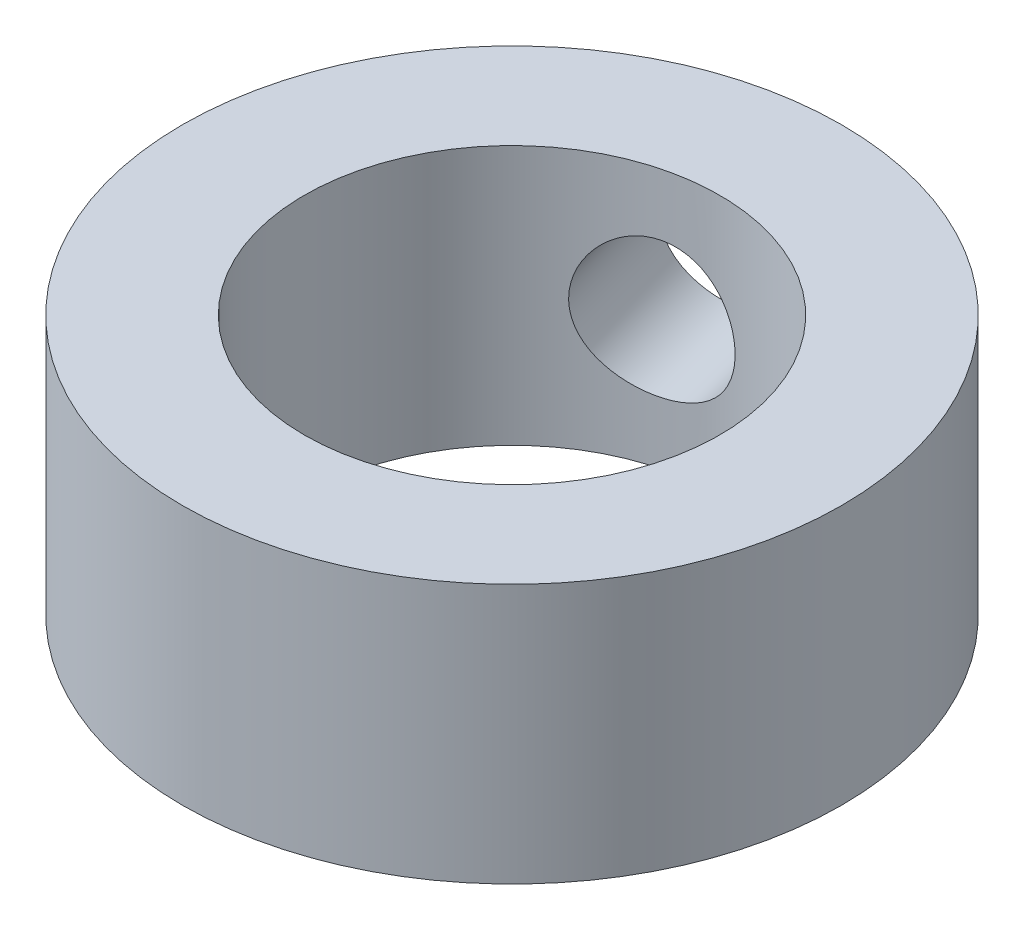
ISO-10303-21;
HEADER;
FILE_DESCRIPTION(('STEP AP214'),'2;1');
FILE_NAME('part.step','',(''),(''),'','','');
FILE_SCHEMA(('AUTOMOTIVE_DESIGN { 1 0 10303 214 1 1 1 1 }'));
ENDSEC;
DATA;
#1=APPLICATION_CONTEXT('core data for automotive mechanical design processes');
#2=APPLICATION_PROTOCOL_DEFINITION('international standard','automotive_design',2000,#1);
#3=PRODUCT_CONTEXT('',#1,'mechanical');
#4=PRODUCT('Part','Part','',(#3));
#5=PRODUCT_RELATED_PRODUCT_CATEGORY('part','',(#4));
#6=PRODUCT_DEFINITION_FORMATION('','',#4);
#7=PRODUCT_DEFINITION_CONTEXT('part definition',#1,'design');
#8=PRODUCT_DEFINITION('design','',#6,#7);
#9=PRODUCT_DEFINITION_SHAPE('','',#8);
#10=(LENGTH_UNIT() NAMED_UNIT(*) SI_UNIT(.MILLI.,.METRE.));
#11=(NAMED_UNIT(*) PLANE_ANGLE_UNIT() SI_UNIT($,.RADIAN.));
#12=(NAMED_UNIT(*) SI_UNIT($,.STERADIAN.) SOLID_ANGLE_UNIT());
#13=UNCERTAINTY_MEASURE_WITH_UNIT(LENGTH_MEASURE(1.E-05),#10,'distance_accuracy_value','');
#14=(GEOMETRIC_REPRESENTATION_CONTEXT(3) GLOBAL_UNCERTAINTY_ASSIGNED_CONTEXT((#13)) GLOBAL_UNIT_ASSIGNED_CONTEXT((#10,
#11,#12)) REPRESENTATION_CONTEXT('',''));
#15=CARTESIAN_POINT('',(0.,0.,0.));
#16=DIRECTION('',(0.,0.,1.));
#17=DIRECTION('',(1.,0.,0.));
#18=AXIS2_PLACEMENT_3D('',#15,#16,#17);
#19=CARTESIAN_POINT('',(0.,20.,0.));
#20=DIRECTION('',(0.,-1.,0.));
#21=DIRECTION('',(0.,0.,-1.));
#22=AXIS2_PLACEMENT_3D('',#19,#20,#21);
#23=CYLINDRICAL_SURFACE('',#22,25.4);
#24=CARTESIAN_POINT('',(-11.3949661213959,10.,-22.700545083593));
#25=CARTESIAN_POINT('',(-11.3949686574322,9.8542037203055,-22.7005426287149));
#26=CARTESIAN_POINT('',(-11.3894176177606,9.7084451930408,-22.7033324910437));
#27=CARTESIAN_POINT('',(-11.3672560080408,9.41793980072636,-22.7144372196689));
#28=CARTESIAN_POINT('',(-11.3506436402837,9.27319310398597,-22.7227529840455));
#29=CARTESIAN_POINT('',(-11.306457133404,8.98573026429417,-22.7447715199994));
#30=CARTESIAN_POINT('',(-11.2788775489652,8.8430151665637,-22.7584769675627));
#31=CARTESIAN_POINT('',(-11.2129304389085,8.56064333434581,-22.7910408502947));
#32=CARTESIAN_POINT('',(-11.1745589399879,8.42098774674183,-22.8099011832862));
#33=CARTESIAN_POINT('',(-11.0873451358636,8.14596077252988,-22.8524205593688));
#34=CARTESIAN_POINT('',(-11.0385177489886,8.01058359409658,-22.8760727629146));
#35=CARTESIAN_POINT('',(-10.9306494178329,7.74477973608957,-22.9278101947273));
#36=CARTESIAN_POINT('',(-10.8716047050656,7.61435490482544,-22.9558970583072));
#37=CARTESIAN_POINT('',(-10.7437043746201,7.35943648530064,-23.0160336538669));
#38=CARTESIAN_POINT('',(-10.6748530085746,7.23494035772483,-23.0480816677148));
#39=CARTESIAN_POINT('',(-10.5277034509867,6.99259326121771,-23.1156660092184));
#40=CARTESIAN_POINT('',(-10.4494017287135,6.87474480018852,-23.1512036396934));
#41=CARTESIAN_POINT('',(-10.2827353659178,6.64500595445793,-23.2257140332537));
#42=CARTESIAN_POINT('',(-10.194251651498,6.53321462177375,-23.2647259126189));
#43=CARTESIAN_POINT('',(-10.0085634958785,6.31800282425375,-23.3452114411407));
#44=CARTESIAN_POINT('',(-9.91135583404942,6.21458547787581,-23.3866859975187));
#45=CARTESIAN_POINT('',(-9.70884860480748,6.01689422168651,-23.4714784758814));
#46=CARTESIAN_POINT('',(-9.60355141528477,5.92261764326848,-23.5147958545164));
#47=CARTESIAN_POINT('',(-9.38542423585369,5.74378793532573,-23.6027041186518));
#48=CARTESIAN_POINT('',(-9.27259148455468,5.65923840149988,-23.6472954675327));
#49=CARTESIAN_POINT('',(-9.03906091367094,5.4997835069332,-23.7375479700936));
#50=CARTESIAN_POINT('',(-8.91830148441343,5.42497172243659,-23.7832151384452));
#51=CARTESIAN_POINT('',(-8.67056065003231,5.28642121153233,-23.8746481038485));
#52=CARTESIAN_POINT('',(-8.54357693161173,5.22268664266526,-23.9204139314331));
#53=CARTESIAN_POINT('',(-8.28430189383663,5.1068372046235,-24.0114386749655));
#54=CARTESIAN_POINT('',(-8.15201298443859,5.05471712840042,-24.0566978093972));
#55=CARTESIAN_POINT('',(-7.88297292897661,4.9624564037448,-24.1461986472177));
#56=CARTESIAN_POINT('',(-7.74622018451666,4.92232009980148,-24.190439976269));
#57=CARTESIAN_POINT('',(-7.33466771205289,4.82142645201832,-24.3196233167342));
#58=CARTESIAN_POINT('',(-7.0545984778643,4.77841538664733,-24.4024305901958));
#59=CARTESIAN_POINT('',(-6.48891895342731,4.74186526558015,-24.5589126875293));
#60=CARTESIAN_POINT('',(-6.20330923490009,4.74832113220614,-24.6325884479432));
#61=CARTESIAN_POINT('',(-5.63910857041918,4.80993441530352,-24.7677876712837));
#62=CARTESIAN_POINT('',(-5.36047693423994,4.86434984618236,-24.8294788738038));
#63=CARTESIAN_POINT('',(-4.81388408458172,5.01917670288689,-24.9412191108017));
#64=CARTESIAN_POINT('',(-4.54592331865241,5.11959005571928,-24.9912676573972));
#65=CARTESIAN_POINT('',(-4.02659474532817,5.36423436433418,-25.0802006450813));
#66=CARTESIAN_POINT('',(-3.77534938271638,5.50875279704981,-25.1190084838859));
#67=CARTESIAN_POINT('',(-3.29858450593492,5.83729290757149,-25.1860554697708));
#68=CARTESIAN_POINT('',(-3.07306814792324,6.021319423843,-25.2142933212057));
#69=CARTESIAN_POINT('',(-2.65035602926807,6.42771258218978,-25.2622599889264));
#70=CARTESIAN_POINT('',(-2.45376521109053,6.65072882180872,-25.2818207264009));
#71=CARTESIAN_POINT('',(-2.1000912229296,7.12663153743517,-25.3136572496695));
#72=CARTESIAN_POINT('',(-1.94300890549092,7.37951865784642,-25.3259328782677));
#73=CARTESIAN_POINT('',(-1.6731808382118,7.90892543762998,-25.3451947219864));
#74=CARTESIAN_POINT('',(-1.56054288741701,8.18550060030619,-25.3521681141036));
#75=CARTESIAN_POINT('',(-1.38416161698901,8.7538857702709,-25.362412780928));
#76=CARTESIAN_POINT('',(-1.32041144965996,9.04569363780149,-25.3656845741476));
#77=CARTESIAN_POINT('',(-1.2448794901046,9.63055467969738,-25.3695032375983));
#78=CARTESIAN_POINT('',(-1.23217039250848,9.92348790931901,-25.3700987540148));
#79=CARTESIAN_POINT('',(-1.25663836106811,10.5072437760056,-25.3688983881113));
#80=CARTESIAN_POINT('',(-1.2938123925861,10.7980665403785,-25.3671026512631));
#81=CARTESIAN_POINT('',(-1.41602124160598,11.366252029287,-25.3605703034939));
#82=CARTESIAN_POINT('',(-1.50055644832922,11.6437229527907,-25.355864339485));
#83=CARTESIAN_POINT('',(-1.71419326768912,12.1808278783068,-25.342314960731));
#84=CARTESIAN_POINT('',(-1.84329876227715,12.4404603242737,-25.3334711855698));
#85=CARTESIAN_POINT('',(-2.14397000662465,12.938481550661,-25.3098076355169));
#86=CARTESIAN_POINT('',(-2.31609949545547,13.1765259885616,-25.2949067261043));
#87=CARTESIAN_POINT('',(-2.69653544852218,13.620997015399,-25.2571801836372));
#88=CARTESIAN_POINT('',(-2.90484590217691,13.8274201129459,-25.2343536764055));
#89=CARTESIAN_POINT('',(-3.35518032006567,14.2062648123818,-25.1784629719225));
#90=CARTESIAN_POINT('',(-3.59770339789317,14.3780698702064,-25.1452362251814));
#91=CARTESIAN_POINT('',(-4.10652990913368,14.6784148372513,-25.0671605428036));
#92=CARTESIAN_POINT('',(-4.37283230116776,14.8069566399454,-25.0223121159572));
#93=CARTESIAN_POINT('',(-4.91952685253712,15.016245798997,-24.9205759070931));
#94=CARTESIAN_POINT('',(-5.19982463170899,15.0972759757957,-24.8637621610279));
#95=CARTESIAN_POINT('',(-5.76771841094052,15.2101175687805,-24.7381833621658));
#96=CARTESIAN_POINT('',(-6.05531346425939,15.2419353368822,-24.6694198530164));
#97=CARTESIAN_POINT('',(-6.48260534526029,15.2519554704946,-24.5592586302906));
#98=CARTESIAN_POINT('',(-6.62310762087678,15.2491994670923,-24.5217365484845));
#99=CARTESIAN_POINT('',(-6.90273319627944,15.231645194805,-24.4444929392524));
#100=CARTESIAN_POINT('',(-7.0418569998955,15.2168515033976,-24.4047722532224));
#101=CARTESIAN_POINT('',(-7.31779665240007,15.175326970636,-24.323457213974));
#102=CARTESIAN_POINT('',(-7.45461168994115,15.1485920199507,-24.2818622201866));
#103=CARTESIAN_POINT('',(-7.7249106990165,15.0834102514887,-24.1972270869507));
#104=CARTESIAN_POINT('',(-7.85839584118089,15.0449676141799,-24.1541874682078));
#105=CARTESIAN_POINT('',(-8.12089693126966,14.9567629296061,-24.0671999296165));
#106=CARTESIAN_POINT('',(-8.24992226514935,14.9070265635644,-24.0232542730534));
#107=CARTESIAN_POINT('',(-8.50294795679098,14.7965780743989,-23.9348664087266));
#108=CARTESIAN_POINT('',(-8.62695007233581,14.7358698320134,-23.8904243817262));
#109=CARTESIAN_POINT('',(-8.86926055008253,14.6038777737804,-23.8015310603052));
#110=CARTESIAN_POINT('',(-8.98756652081793,14.532589566448,-23.757079769727));
#111=CARTESIAN_POINT('',(-9.21768035953034,14.3799832637829,-23.6687463804406));
#112=CARTESIAN_POINT('',(-9.32949043158483,14.2986686000429,-23.6248640926403));
#113=CARTESIAN_POINT('',(-9.54790174052592,14.1250348061434,-23.5374521038117));
#114=CARTESIAN_POINT('',(-9.65437752882324,14.0325479538123,-23.493942022797));
#115=CARTESIAN_POINT('',(-9.85930555876516,13.8384118874026,-23.408682342555));
#116=CARTESIAN_POINT('',(-9.95776059525009,13.7367658910651,-23.3669321325668));
#117=CARTESIAN_POINT('',(-10.1461691308755,13.524904528005,-23.2857420627589));
#118=CARTESIAN_POINT('',(-10.2361175083268,13.414684070637,-23.2463036001603));
#119=CARTESIAN_POINT('',(-10.4068857511373,13.1865058304199,-23.1703573787391));
#120=CARTESIAN_POINT('',(-10.4877089524723,13.0685509002262,-23.1338485503241));
#121=CARTESIAN_POINT('',(-10.6407025457246,12.8241869344816,-23.0638811412704));
#122=CARTESIAN_POINT('',(-10.7127568187653,12.6976930925081,-23.0304646605911));
#123=CARTESIAN_POINT('',(-10.8465881368712,12.4384694470746,-22.9677379682637));
#124=CARTESIAN_POINT('',(-10.9083689681205,12.3057419641972,-22.9384262444759));
#125=CARTESIAN_POINT('',(-11.0212577552656,12.0350083254939,-22.8844007281955));
#126=CARTESIAN_POINT('',(-11.0723720045759,11.8970053394785,-22.8596842254106));
#127=CARTESIAN_POINT('',(-11.1636240500915,11.6166816107176,-22.8152594468278));
#128=CARTESIAN_POINT('',(-11.2037639166728,11.4743616880212,-22.795550226429));
#129=CARTESIAN_POINT('',(-11.2902209651342,11.1137277716083,-22.7528972478988));
#130=CARTESIAN_POINT('',(-11.3294546175725,10.8932657361951,-22.7333300932618));
#131=CARTESIAN_POINT('',(-11.3818247361304,10.448505940335,-22.7071561517606));
#132=CARTESIAN_POINT('',(-11.3949622214303,10.2242083300307,-22.7005488587519));
#133=CARTESIAN_POINT('',(-11.3949661213959,10.,-22.700545083593));
#134=B_SPLINE_CURVE_WITH_KNOTS('',3,(#24,#25,#26,#27,#28,#29,#30,#31,#32,#33,#34,#35,#36,#37,
#38,#39,#40,#41,#42,#43,#44,#45,#46,#47,#48,#49,#50,#51,#52,#53,#54,#55,#56,#57,#58,#59,#60,#61,
#62,#63,#64,#65,#66,#67,#68,#69,#70,#71,#72,#73,#74,#75,#76,#77,#78,#79,#80,#81,#82,#83,#84,#85,
#86,#87,#88,#89,#90,#91,#92,#93,#94,#95,#96,#97,#98,#99,#100,#101,#102,#103,#104,#105,#106,#107,
#108,#109,#110,#111,#112,#113,#114,#115,#116,#117,#118,#119,#120,#121,#122,#123,#124,#125,#126,
#127,#128,#129,#130,#131,#132,#133),.UNSPECIFIED.,.T.,.F.,(4,2,2,2,2,2,2,2,2,2,2,2,2,2,2,2,2,2,
2,2,2,2,2,2,2,2,2,2,2,2,2,2,2,2,2,2,2,2,2,2,2,2,2,2,2,2,2,2,2,2,2,2,2,2,4),(0.,0.4371916397258,
0.874454350055236,1.31193443665189,1.7495758033862,2.18659686061223,2.62377945052163,
3.06077307547454,3.4979304731905,3.94085215316001,4.3839380249814,4.82689414786428,
5.27001349130048,5.7171181376969,6.16439023233453,6.61146139920692,7.05869444700077,
7.93962195082291,8.82045903047761,9.68790323484875,10.5553837826813,11.4286439072557,
12.302011039088,13.1916265992847,14.0812613546412,14.973040831461,15.8646953741945,
16.7400751502552,17.6154016750434,18.4816637199906,19.348001233059,20.2263470986855,
21.1047898748464,21.997712334715,22.8905957095617,23.7781086318926,24.6655069921027,
25.1014381543361,25.5372036258546,25.9731191724935,26.408879248748,26.8436581847924,
27.2782836399915,27.7130900047779,28.147747966361,28.5900149264529,29.0321271130111,
29.4745038140649,29.9167182640668,30.3642662698568,30.8116489685513,31.2587669549517,
31.7058005318568,32.378148523901,33.0504702570186),.UNSPECIFIED.);
#135=CARTESIAN_POINT('',(-11.3949661213959,10.,-22.700545083593));
#136=VERTEX_POINT('',#135);
#137=EDGE_CURVE('E10',#136,#136,#134,.T.);
#138=ORIENTED_EDGE('',*,*,#137,.T.);
#139=EDGE_LOOP('',(#138));
#140=FACE_BOUND('',#139,.T.);
#141=CARTESIAN_POINT('',(0.,20.,0.));
#142=DIRECTION('',(0.,1.,0.));
#143=DIRECTION('',(0.,0.,1.));
#144=AXIS2_PLACEMENT_3D('',#141,#142,#143);
#145=CIRCLE('',#144,25.4);
#146=CARTESIAN_POINT('',(0.,20.,25.4));
#147=VERTEX_POINT('',#146);
#148=EDGE_CURVE('E39',#147,#147,#145,.T.);
#149=ORIENTED_EDGE('',*,*,#148,.F.);
#150=EDGE_LOOP('',(#149));
#151=FACE_BOUND('',#150,.T.);
#152=CARTESIAN_POINT('',(0.,0.,0.));
#153=DIRECTION('',(0.,1.,0.));
#154=DIRECTION('',(0.,0.,1.));
#155=AXIS2_PLACEMENT_3D('',#152,#153,#154);
#156=CIRCLE('',#155,25.4);
#157=CARTESIAN_POINT('',(0.,0.,25.4));
#158=VERTEX_POINT('',#157);
#159=EDGE_CURVE('E43',#158,#158,#156,.T.);
#160=ORIENTED_EDGE('',*,*,#159,.T.);
#161=EDGE_LOOP('',(#160));
#162=FACE_BOUND('',#161,.T.);
#163=ADVANCED_FACE('F29',(#140,#151,#162),#23,.T.);
#164=CARTESIAN_POINT('',(0.,20.,0.));
#165=DIRECTION('',(0.,1.,0.));
#166=DIRECTION('',(0.,0.,1.));
#167=AXIS2_PLACEMENT_3D('',#164,#165,#166);
#168=PLANE('',#167);
#169=CARTESIAN_POINT('',(0.,20.,0.));
#170=DIRECTION('',(0.,1.,0.));
#171=DIRECTION('',(0.,0.,1.));
#172=AXIS2_PLACEMENT_3D('',#169,#170,#171);
#173=CIRCLE('',#172,16.);
#174=CARTESIAN_POINT('',(0.,20.,16.));
#175=VERTEX_POINT('',#174);
#176=EDGE_CURVE('E50',#175,#175,#173,.T.);
#177=ORIENTED_EDGE('',*,*,#176,.F.);
#178=EDGE_LOOP('',(#177));
#179=FACE_BOUND('',#178,.T.);
#180=ORIENTED_EDGE('',*,*,#148,.T.);
#181=EDGE_LOOP('',(#180));
#182=FACE_BOUND('',#181,.T.);
#183=ADVANCED_FACE('F75',(#179,#182),#168,.T.);
#184=CARTESIAN_POINT('',(0.,0.,0.));
#185=DIRECTION('',(0.,1.,0.));
#186=DIRECTION('',(0.,0.,1.));
#187=AXIS2_PLACEMENT_3D('',#184,#185,#186);
#188=PLANE('',#187);
#189=CARTESIAN_POINT('',(0.,0.,0.));
#190=DIRECTION('',(0.,1.,0.));
#191=DIRECTION('',(0.,0.,1.));
#192=AXIS2_PLACEMENT_3D('',#189,#190,#191);
#193=CIRCLE('',#192,16.);
#194=CARTESIAN_POINT('',(0.,0.,16.));
#195=VERTEX_POINT('',#194);
#196=EDGE_CURVE('E48',#195,#195,#193,.T.);
#197=ORIENTED_EDGE('',*,*,#196,.T.);
#198=EDGE_LOOP('',(#197));
#199=FACE_BOUND('',#198,.T.);
#200=ORIENTED_EDGE('',*,*,#159,.F.);
#201=EDGE_LOOP('',(#200));
#202=FACE_BOUND('',#201,.T.);
#203=ADVANCED_FACE('F71',(#199,#202),#188,.F.);
#204=CARTESIAN_POINT('',(0.,0.,0.));
#205=DIRECTION('',(0.,1.,0.));
#206=DIRECTION('',(0.,0.,1.));
#207=AXIS2_PLACEMENT_3D('',#204,#205,#206);
#208=CYLINDRICAL_SURFACE('',#207,16.);
#209=CARTESIAN_POINT('',(-8.91966023966802,10.,-13.2830591811106));
#210=CARTESIAN_POINT('',(-8.91966063926234,10.2862399912378,-13.2830588978193));
#211=CARTESIAN_POINT('',(-8.89903276283584,10.5724790069683,-13.2969805023131));
#212=CARTESIAN_POINT('',(-8.81714845321764,11.1364949318347,-13.3514138789228));
#213=CARTESIAN_POINT('',(-8.75588426572534,11.4142702153212,-13.3919307259797));
#214=CARTESIAN_POINT('',(-8.59457889309179,11.9530997868456,-13.4960113399409));
#215=CARTESIAN_POINT('',(-8.49461179381224,12.2141849176572,-13.5595310593803));
#216=CARTESIAN_POINT('',(-8.25822988223364,12.7138017635542,-13.7047733653584));
#217=CARTESIAN_POINT('',(-8.12180742287888,12.9523287324993,-13.7864997704221));
#218=CARTESIAN_POINT('',(-7.80991996833317,13.4090988821987,-13.9656189601462));
#219=CARTESIAN_POINT('',(-7.63327340936595,13.6263621147882,-14.0634539353141));
#220=CARTESIAN_POINT('',(-7.24720530022967,14.0256483131268,-14.2662363798859));
#221=CARTESIAN_POINT('',(-7.03777867765284,14.2076658151615,-14.3711849486244));
#222=CARTESIAN_POINT('',(-6.58453468778676,14.5357088642128,-14.584515911257));
#223=CARTESIAN_POINT('',(-6.33998383112029,14.6807121346096,-14.692918203698));
#224=CARTESIAN_POINT('',(-5.82635095214381,14.9238550635939,-14.904046134474));
#225=CARTESIAN_POINT('',(-5.55727534527305,15.0220069363935,-15.0067732461528));
#226=CARTESIAN_POINT('',(-5.01127226850493,15.165350860901,-15.1976287720983));
#227=CARTESIAN_POINT('',(-4.73491750491432,15.2122206628969,-15.2861332364966));
#228=CARTESIAN_POINT('',(-4.17413591740936,15.2569998107175,-15.448680365667));
#229=CARTESIAN_POINT('',(-3.88971112882599,15.2549213939875,-15.5227266404343));
#230=CARTESIAN_POINT('',(-3.33243501284133,15.2029373758687,-15.6516333438569));
#231=CARTESIAN_POINT('',(-3.05955480414892,15.1548531678085,-15.7071161828038));
#232=CARTESIAN_POINT('',(-2.52231966191649,15.0152285393295,-15.8022899915352));
#233=CARTESIAN_POINT('',(-2.25796530258159,14.9236851984931,-15.8419798997184));
#234=CARTESIAN_POINT('',(-1.741800047591,14.6986504931013,-15.9070655975076));
#235=CARTESIAN_POINT('',(-1.490195505722,14.5646321050164,-15.9322699517356));
#236=CARTESIAN_POINT('',(-1.00998425127104,14.2588828999032,-15.969910243933));
#237=CARTESIAN_POINT('',(-0.781383816490806,14.0871418288635,-15.9823427049413));
#238=CARTESIAN_POINT('',(-0.343457654033086,13.701599361394,-15.9978829296414));
#239=CARTESIAN_POINT('',(-0.135490535437444,13.4862342741626,-16.0005385048958));
#240=CARTESIAN_POINT('',(0.242333224012554,13.0242779746565,-15.9992831300421));
#241=CARTESIAN_POINT('',(0.412184364165879,12.7776822633624,-15.9953712328403));
#242=CARTESIAN_POINT('',(0.709901094800123,12.2558627499943,-15.9849497583756));
#243=CARTESIAN_POINT('',(0.837171925272613,11.9802988274958,-15.9784059859752));
#244=CARTESIAN_POINT('',(1.04117205123881,11.4110500224792,-15.9664186935092));
#245=CARTESIAN_POINT('',(1.11792174467355,11.1173725057812,-15.9609747300111));
#246=CARTESIAN_POINT('',(1.21506941056315,10.5340362613495,-15.9538675164095));
#247=CARTESIAN_POINT('',(1.23779181004801,10.244766428925,-15.9520488845533));
#248=CARTESIAN_POINT('',(1.23263991700811,9.66671144498492,-15.9524487149529));
#249=CARTESIAN_POINT('',(1.20477445266815,9.37792621770276,-15.9546664728106));
#250=CARTESIAN_POINT('',(1.10153971498755,8.8189455397546,-15.9621147594001));
#251=CARTESIAN_POINT('',(1.02776478341286,8.54845108055946,-15.9672436839233));
#252=CARTESIAN_POINT('',(0.837202744990424,8.02310292825077,-15.9783647183873));
#253=CARTESIAN_POINT('',(0.720408164016163,7.76825196198013,-15.9843569782116));
#254=CARTESIAN_POINT('',(0.443739593959418,7.27268318887594,-15.9944605927902));
#255=CARTESIAN_POINT('',(0.28264370178204,7.0326473205719,-15.9985079638044));
#256=CARTESIAN_POINT('',(-0.0756453724263128,6.58115439236188,-16.000822523933));
#257=CARTESIAN_POINT('',(-0.272848875642383,6.3697055340331,-15.999088057892));
#258=CARTESIAN_POINT('',(-0.707597086558782,5.97125654235613,-15.9858898938421));
#259=CARTESIAN_POINT('',(-0.946588734952094,5.78584543117599,-15.9739786325804));
#260=CARTESIAN_POINT('',(-1.45085468261461,5.45685753542078,-15.9360866301769));
#261=CARTESIAN_POINT('',(-1.71612796724952,5.31327913668603,-15.9101064320105));
#262=CARTESIAN_POINT('',(-2.26311255168654,5.07336753879086,-15.8415179303172));
#263=CARTESIAN_POINT('',(-2.54469821488449,4.97671611925976,-15.7990252465039));
#264=CARTESIAN_POINT('',(-3.11704514358861,4.83277933742825,-15.6961277497238));
#265=CARTESIAN_POINT('',(-3.40780317441214,4.78547676814028,-15.6357291896283));
#266=CARTESIAN_POINT('',(-3.97573292791548,4.74309118769905,-15.5008020032012));
#267=CARTESIAN_POINT('',(-4.25291912643824,4.74572358701045,-15.4270440103103));
#268=CARTESIAN_POINT('',(-4.79886669862669,4.79752595364832,-15.2660362095198));
#269=CARTESIAN_POINT('',(-5.0676287187456,4.84669234098017,-15.1787874399367));
#270=CARTESIAN_POINT('',(-5.58545061304857,4.98866595340312,-14.9959025374552));
#271=CARTESIAN_POINT('',(-5.83474539957566,5.08080807850382,-14.9004117057324));
#272=CARTESIAN_POINT('',(-6.31226962510593,5.3055060255068,-14.704486977212));
#273=CARTESIAN_POINT('',(-6.54049528671131,5.4380690760517,-14.604052198964));
#274=CARTESIAN_POINT('',(-6.97909937985156,5.7453792565591,-14.3997516446595));
#275=CARTESIAN_POINT('',(-7.18853213382534,5.92148023837901,-14.2958933396724));
#276=CARTESIAN_POINT('',(-7.57590560144923,6.30854309099373,-14.0944461866331));
#277=CARTESIAN_POINT('',(-7.75383638994859,6.51951590832766,-13.9968593206358));
#278=CARTESIAN_POINT('',(-8.08091443374285,6.97982172670808,-13.8107065452109));
#279=CARTESIAN_POINT('',(-8.22872839272958,7.23029853040813,-13.7226175879666));
#280=CARTESIAN_POINT('',(-8.48355648197312,7.75695644457665,-13.5665658788367));
#281=CARTESIAN_POINT('',(-8.59058281906968,8.03312983378813,-13.4985971067831));
#282=CARTESIAN_POINT('',(-8.75635190910351,8.58769349802542,-13.3916219496866));
#283=CARTESIAN_POINT('',(-8.81744378627977,8.86511090751127,-13.3512180700258));
#284=CARTESIAN_POINT('',(-8.89909131800429,9.42835433458491,-13.2969410382062));
#285=CARTESIAN_POINT('',(-8.91965984065673,9.71417765362375,-13.2830594639885));
#286=CARTESIAN_POINT('',(-8.91966023966802,10.,-13.2830591811106));
#287=B_SPLINE_CURVE_WITH_KNOTS('',3,(#209,#210,#211,#212,#213,#214,#215,#216,#217,#218,#219,
#220,#221,#222,#223,#224,#225,#226,#227,#228,#229,#230,#231,#232,#233,#234,#235,#236,#237,#238,
#239,#240,#241,#242,#243,#244,#245,#246,#247,#248,#249,#250,#251,#252,#253,#254,#255,#256,#257,
#258,#259,#260,#261,#262,#263,#264,#265,#266,#267,#268,#269,#270,#271,#272,#273,#274,#275,#276,
#277,#278,#279,#280,#281,#282,#283,#284,#285,#286),.UNSPECIFIED.,.T.,.F.,(4,2,2,2,2,2,2,2,2,2,2,
2,2,2,2,2,2,2,2,2,2,2,2,2,2,2,2,2,2,2,2,2,2,2,2,2,2,2,4),(0.,0.857662200731014,1.71548810934703,
2.57168000579665,3.42805164244488,4.31388065648356,5.19984688002418,6.10813339010177,
7.01618297936069,7.89354360994141,8.77068489569308,9.61447728120183,10.4583263768849,
11.3130851674632,12.168076591998,13.0621480471497,13.9563484472152,14.8625629319768,
15.7684113072808,16.6345203385931,17.5004782380919,18.3379232251313,19.1755137764532,
20.0390388124152,20.9028110692555,21.8066498220125,22.7104536945702,23.6080400035178,
24.5053132368084,25.3616382800044,26.2178974489868,27.0613236438353,27.9049007606583,
28.77902841989,29.6534309974957,30.5607004111564,31.467698085371,32.3243809765719,
33.1807917860858),.UNSPECIFIED.);
#288=CARTESIAN_POINT('',(-8.91966023966802,10.,-13.2830591811106));
#289=VERTEX_POINT('',#288);
#290=EDGE_CURVE('E53',#289,#289,#287,.T.);
#291=ORIENTED_EDGE('',*,*,#290,.T.);
#292=EDGE_LOOP('',(#291));
#293=FACE_BOUND('',#292,.T.);
#294=ORIENTED_EDGE('',*,*,#196,.F.);
#295=EDGE_LOOP('',(#294));
#296=FACE_BOUND('',#295,.T.);
#297=ORIENTED_EDGE('',*,*,#176,.T.);
#298=EDGE_LOOP('',(#297));
#299=FACE_BOUND('',#298,.T.);
#300=ADVANCED_FACE('F60',(#293,#296,#299),#208,.F.);
#301=CARTESIAN_POINT('',(-6.45685990270318,10.,-24.565605227571));
#302=DIRECTION('',(-0.25420708278359,0.,-0.967149812109095));
#303=DIRECTION('',(-0.967149812109095,0.,0.25420708278359));
#304=AXIS2_PLACEMENT_3D('',#301,#302,#303);
#305=CYLINDRICAL_SURFACE('',#304,5.24999999999999);
#306=ORIENTED_EDGE('',*,*,#137,.F.);
#307=EDGE_LOOP('',(#306));
#308=FACE_BOUND('',#307,.T.);
#309=ORIENTED_EDGE('',*,*,#290,.F.);
#310=EDGE_LOOP('',(#309));
#311=FACE_BOUND('',#310,.T.);
#312=ADVANCED_FACE('F63',(#308,#311),#305,.F.);
#313=CLOSED_SHELL('',(#163,#183,#203,#300,#312));
#314=MANIFOLD_SOLID_BREP('B2',#313);
#315=ADVANCED_BREP_SHAPE_REPRESENTATION('',(#18,#314),#14);
#316=SHAPE_DEFINITION_REPRESENTATION(#9,#315);
ENDSEC;
END-ISO-10303-21;
